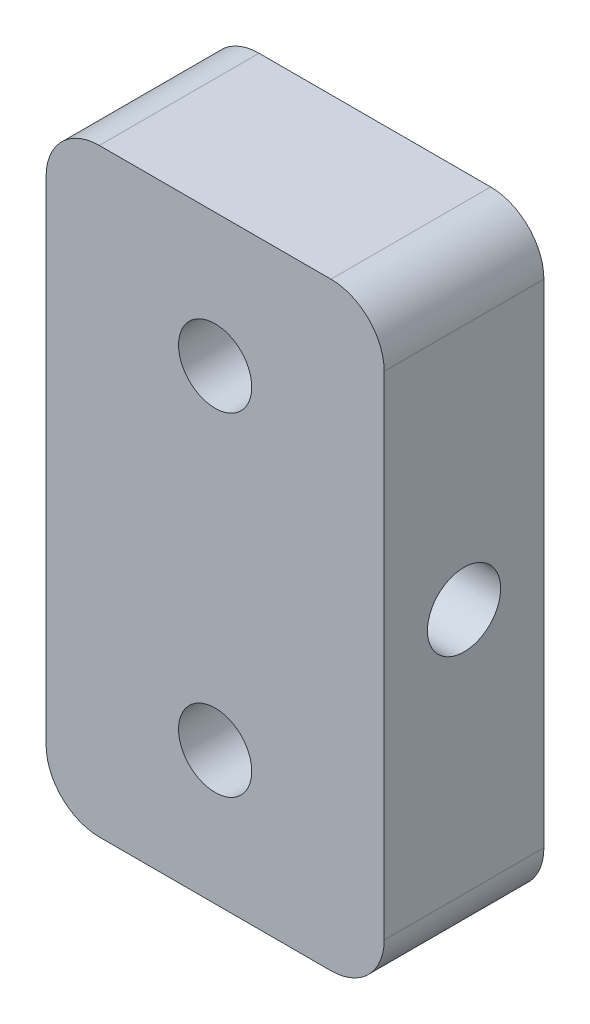
ISO-10303-21;
HEADER;
FILE_DESCRIPTION(('STEP AP214'),'2;1');
FILE_NAME('part.step','',(''),(''),'','','');
FILE_SCHEMA(('AUTOMOTIVE_DESIGN { 1 0 10303 214 1 1 1 1 }'));
ENDSEC;
DATA;
#1=APPLICATION_CONTEXT('core data for automotive mechanical design processes');
#2=APPLICATION_PROTOCOL_DEFINITION('international standard','automotive_design',2000,#1);
#3=PRODUCT_CONTEXT('',#1,'mechanical');
#4=PRODUCT('Part','Part','',(#3));
#5=PRODUCT_RELATED_PRODUCT_CATEGORY('part','',(#4));
#6=PRODUCT_DEFINITION_FORMATION('','',#4);
#7=PRODUCT_DEFINITION_CONTEXT('part definition',#1,'design');
#8=PRODUCT_DEFINITION('design','',#6,#7);
#9=PRODUCT_DEFINITION_SHAPE('','',#8);
#10=(LENGTH_UNIT() NAMED_UNIT(*) SI_UNIT(.MILLI.,.METRE.));
#11=(NAMED_UNIT(*) PLANE_ANGLE_UNIT() SI_UNIT($,.RADIAN.));
#12=(NAMED_UNIT(*) SI_UNIT($,.STERADIAN.) SOLID_ANGLE_UNIT());
#13=UNCERTAINTY_MEASURE_WITH_UNIT(LENGTH_MEASURE(1.E-05),#10,'distance_accuracy_value','');
#14=(GEOMETRIC_REPRESENTATION_CONTEXT(3) GLOBAL_UNCERTAINTY_ASSIGNED_CONTEXT((#13)) GLOBAL_UNIT_ASSIGNED_CONTEXT((#10,
#11,#12)) REPRESENTATION_CONTEXT('',''));
#15=CARTESIAN_POINT('',(0.,0.,0.));
#16=DIRECTION('',(0.,0.,1.));
#17=DIRECTION('',(1.,0.,0.));
#18=AXIS2_PLACEMENT_3D('',#15,#16,#17);
#19=CARTESIAN_POINT('',(-12.7,-22.5,6.));
#20=DIRECTION('',(1.,0.,0.));
#21=DIRECTION('',(0.,0.,-1.));
#22=AXIS2_PLACEMENT_3D('',#19,#20,#21);
#23=PLANE('',#22);
#24=CARTESIAN_POINT('',(-12.7,0.,0.));
#25=DIRECTION('',(-1.,0.,0.));
#26=DIRECTION('',(0.,0.,1.));
#27=AXIS2_PLACEMENT_3D('',#24,#25,#26);
#28=CIRCLE('',#27,2.74999999999999);
#29=CARTESIAN_POINT('',(-12.7,0.,2.74999999999999));
#30=VERTEX_POINT('',#29);
#31=EDGE_CURVE('E186',#30,#30,#28,.T.);
#32=ORIENTED_EDGE('',*,*,#31,.F.);
#33=EDGE_LOOP('',(#32));
#34=FACE_BOUND('',#33,.T.);
#35=DIRECTION('',(0.,-1.,0.));
#36=VECTOR('',#35,1.);
#37=CARTESIAN_POINT('',(-12.7,-22.5,-6.));
#38=LINE('',#37,#36);
#39=CARTESIAN_POINT('',(-12.7,18.5,-6.));
#40=VERTEX_POINT('',#39);
#41=CARTESIAN_POINT('',(-12.7,-18.5,-6.));
#42=VERTEX_POINT('',#41);
#43=EDGE_CURVE('E134',#40,#42,#38,.T.);
#44=ORIENTED_EDGE('',*,*,#43,.T.);
#45=DIRECTION('',(0.,0.,-1.));
#46=VECTOR('',#45,1.);
#47=CARTESIAN_POINT('',(-12.7,-18.5,6.));
#48=LINE('',#47,#46);
#49=CARTESIAN_POINT('',(-12.7,-18.5,6.));
#50=VERTEX_POINT('',#49);
#51=EDGE_CURVE('E112',#42,#50,#48,.F.);
#52=ORIENTED_EDGE('',*,*,#51,.T.);
#53=DIRECTION('',(0.,-1.,0.));
#54=VECTOR('',#53,1.);
#55=CARTESIAN_POINT('',(-12.7,-22.5,6.));
#56=LINE('',#55,#54);
#57=CARTESIAN_POINT('',(-12.7,18.5,6.));
#58=VERTEX_POINT('',#57);
#59=EDGE_CURVE('E144',#58,#50,#56,.T.);
#60=ORIENTED_EDGE('',*,*,#59,.F.);
#61=DIRECTION('',(0.,0.,-1.));
#62=VECTOR('',#61,1.);
#63=CARTESIAN_POINT('',(-12.7,18.5,6.));
#64=LINE('',#63,#62);
#65=EDGE_CURVE('E117',#58,#40,#64,.T.);
#66=ORIENTED_EDGE('',*,*,#65,.T.);
#67=EDGE_LOOP('',(#44,#52,#60,#66));
#68=FACE_BOUND('',#67,.T.);
#69=ADVANCED_FACE('F41',(#34,#68),#23,.F.);
#70=CARTESIAN_POINT('',(12.7,-22.5,6.));
#71=DIRECTION('',(0.,1.,0.));
#72=DIRECTION('',(0.,0.,1.));
#73=AXIS2_PLACEMENT_3D('',#70,#71,#72);
#74=PLANE('',#73);
#75=DIRECTION('',(1.,0.,0.));
#76=VECTOR('',#75,1.);
#77=CARTESIAN_POINT('',(12.7,-22.5,6.));
#78=LINE('',#77,#76);
#79=CARTESIAN_POINT('',(-8.7,-22.5,6.));
#80=VERTEX_POINT('',#79);
#81=CARTESIAN_POINT('',(8.7,-22.5,6.));
#82=VERTEX_POINT('',#81);
#83=EDGE_CURVE('E127',#80,#82,#78,.T.);
#84=ORIENTED_EDGE('',*,*,#83,.F.);
#85=DIRECTION('',(0.,0.,-1.));
#86=VECTOR('',#85,1.);
#87=CARTESIAN_POINT('',(-8.7,-22.5,6.));
#88=LINE('',#87,#86);
#89=CARTESIAN_POINT('',(-8.7,-22.5,-6.));
#90=VERTEX_POINT('',#89);
#91=EDGE_CURVE('E111',#80,#90,#88,.T.);
#92=ORIENTED_EDGE('',*,*,#91,.T.);
#93=DIRECTION('',(1.,0.,0.));
#94=VECTOR('',#93,1.);
#95=CARTESIAN_POINT('',(12.7,-22.5,-6.));
#96=LINE('',#95,#94);
#97=CARTESIAN_POINT('',(8.7,-22.5,-6.));
#98=VERTEX_POINT('',#97);
#99=EDGE_CURVE('E124',#90,#98,#96,.T.);
#100=ORIENTED_EDGE('',*,*,#99,.T.);
#101=DIRECTION('',(0.,0.,-1.));
#102=VECTOR('',#101,1.);
#103=CARTESIAN_POINT('',(8.7,-22.5,6.));
#104=LINE('',#103,#102);
#105=EDGE_CURVE('E129',#98,#82,#104,.F.);
#106=ORIENTED_EDGE('',*,*,#105,.T.);
#107=EDGE_LOOP('',(#84,#92,#100,#106));
#108=FACE_BOUND('',#107,.T.);
#109=ADVANCED_FACE('F123',(#108),#74,.F.);
#110=CARTESIAN_POINT('',(12.7,-22.5,6.));
#111=DIRECTION('',(-1.,0.,0.));
#112=DIRECTION('',(0.,0.,1.));
#113=AXIS2_PLACEMENT_3D('',#110,#111,#112);
#114=PLANE('',#113);
#115=CARTESIAN_POINT('',(12.7,0.,0.));
#116=DIRECTION('',(-1.,0.,0.));
#117=DIRECTION('',(0.,0.,1.));
#118=AXIS2_PLACEMENT_3D('',#115,#116,#117);
#119=CIRCLE('',#118,2.75);
#120=CARTESIAN_POINT('',(12.7,0.,2.75));
#121=VERTEX_POINT('',#120);
#122=EDGE_CURVE('E139',#121,#121,#119,.T.);
#123=ORIENTED_EDGE('',*,*,#122,.T.);
#124=EDGE_LOOP('',(#123));
#125=FACE_BOUND('',#124,.T.);
#126=DIRECTION('',(0.,1.,0.));
#127=VECTOR('',#126,1.);
#128=CARTESIAN_POINT('',(12.7,-22.5,6.));
#129=LINE('',#128,#127);
#130=CARTESIAN_POINT('',(12.7,-18.5,6.));
#131=VERTEX_POINT('',#130);
#132=CARTESIAN_POINT('',(12.7,18.5,6.));
#133=VERTEX_POINT('',#132);
#134=EDGE_CURVE('E170',#131,#133,#129,.T.);
#135=ORIENTED_EDGE('',*,*,#134,.F.);
#136=DIRECTION('',(0.,0.,-1.));
#137=VECTOR('',#136,1.);
#138=CARTESIAN_POINT('',(12.7,-18.5,6.));
#139=LINE('',#138,#137);
#140=CARTESIAN_POINT('',(12.7,-18.5,-6.));
#141=VERTEX_POINT('',#140);
#142=EDGE_CURVE('E163',#131,#141,#139,.T.);
#143=ORIENTED_EDGE('',*,*,#142,.T.);
#144=DIRECTION('',(0.,1.,0.));
#145=VECTOR('',#144,1.);
#146=CARTESIAN_POINT('',(12.7,-22.5,-6.));
#147=LINE('',#146,#145);
#148=CARTESIAN_POINT('',(12.7,18.5,-6.));
#149=VERTEX_POINT('',#148);
#150=EDGE_CURVE('E133',#141,#149,#147,.T.);
#151=ORIENTED_EDGE('',*,*,#150,.T.);
#152=DIRECTION('',(0.,0.,-1.));
#153=VECTOR('',#152,1.);
#154=CARTESIAN_POINT('',(12.7,18.5,6.));
#155=LINE('',#154,#153);
#156=EDGE_CURVE('E161',#149,#133,#155,.F.);
#157=ORIENTED_EDGE('',*,*,#156,.T.);
#158=EDGE_LOOP('',(#135,#143,#151,#157));
#159=FACE_BOUND('',#158,.T.);
#160=ADVANCED_FACE('F168',(#125,#159),#114,.F.);
#161=CARTESIAN_POINT('',(12.7,22.5,6.));
#162=DIRECTION('',(0.,-1.,0.));
#163=DIRECTION('',(0.,0.,-1.));
#164=AXIS2_PLACEMENT_3D('',#161,#162,#163);
#165=PLANE('',#164);
#166=DIRECTION('',(-1.,0.,0.));
#167=VECTOR('',#166,1.);
#168=CARTESIAN_POINT('',(12.7,22.5,6.));
#169=LINE('',#168,#167);
#170=CARTESIAN_POINT('',(8.7,22.5,6.));
#171=VERTEX_POINT('',#170);
#172=CARTESIAN_POINT('',(-8.7,22.5,6.));
#173=VERTEX_POINT('',#172);
#174=EDGE_CURVE('E145',#171,#173,#169,.T.);
#175=ORIENTED_EDGE('',*,*,#174,.F.);
#176=DIRECTION('',(0.,0.,-1.));
#177=VECTOR('',#176,1.);
#178=CARTESIAN_POINT('',(8.7,22.5,6.));
#179=LINE('',#178,#177);
#180=CARTESIAN_POINT('',(8.7,22.5,-6.));
#181=VERTEX_POINT('',#180);
#182=EDGE_CURVE('E11',#171,#181,#179,.T.);
#183=ORIENTED_EDGE('',*,*,#182,.T.);
#184=DIRECTION('',(-1.,0.,0.));
#185=VECTOR('',#184,1.);
#186=CARTESIAN_POINT('',(12.7,22.5,-6.));
#187=LINE('',#186,#185);
#188=CARTESIAN_POINT('',(-8.7,22.5,-6.));
#189=VERTEX_POINT('',#188);
#190=EDGE_CURVE('E137',#181,#189,#187,.T.);
#191=ORIENTED_EDGE('',*,*,#190,.T.);
#192=DIRECTION('',(0.,0.,-1.));
#193=VECTOR('',#192,1.);
#194=CARTESIAN_POINT('',(-8.7,22.5,6.));
#195=LINE('',#194,#193);
#196=EDGE_CURVE('E49',#189,#173,#195,.F.);
#197=ORIENTED_EDGE('',*,*,#196,.T.);
#198=EDGE_LOOP('',(#175,#183,#191,#197));
#199=FACE_BOUND('',#198,.T.);
#200=ADVANCED_FACE('F177',(#199),#165,.F.);
#201=CARTESIAN_POINT('',(0.,0.,6.));
#202=DIRECTION('',(0.,0.,1.));
#203=DIRECTION('',(1.,0.,0.));
#204=AXIS2_PLACEMENT_3D('',#201,#202,#203);
#205=PLANE('',#204);
#206=CARTESIAN_POINT('',(0.,12.5,6.));
#207=DIRECTION('',(0.,0.,-1.));
#208=DIRECTION('',(-1.,0.,0.));
#209=AXIS2_PLACEMENT_3D('',#206,#207,#208);
#210=CIRCLE('',#209,2.75);
#211=CARTESIAN_POINT('',(-2.74999999999999,12.5,6.));
#212=VERTEX_POINT('',#211);
#213=EDGE_CURVE('E195',#212,#212,#210,.T.);
#214=ORIENTED_EDGE('',*,*,#213,.T.);
#215=EDGE_LOOP('',(#214));
#216=FACE_BOUND('',#215,.T.);
#217=CARTESIAN_POINT('',(0.,-12.5,6.));
#218=DIRECTION('',(0.,0.,-1.));
#219=DIRECTION('',(-1.,0.,0.));
#220=AXIS2_PLACEMENT_3D('',#217,#218,#219);
#221=CIRCLE('',#220,2.75);
#222=CARTESIAN_POINT('',(-2.75,-12.5,6.));
#223=VERTEX_POINT('',#222);
#224=EDGE_CURVE('E189',#223,#223,#221,.T.);
#225=ORIENTED_EDGE('',*,*,#224,.T.);
#226=EDGE_LOOP('',(#225));
#227=FACE_BOUND('',#226,.T.);
#228=ORIENTED_EDGE('',*,*,#59,.T.);
#229=CARTESIAN_POINT('',(-8.7,-18.5,6.));
#230=DIRECTION('',(0.,0.,1.));
#231=DIRECTION('',(1.,0.,0.));
#232=AXIS2_PLACEMENT_3D('',#229,#230,#231);
#233=CIRCLE('',#232,4.);
#234=EDGE_CURVE('E159',#50,#80,#233,.T.);
#235=ORIENTED_EDGE('',*,*,#234,.T.);
#236=ORIENTED_EDGE('',*,*,#83,.T.);
#237=CARTESIAN_POINT('',(8.7,-18.5,6.));
#238=DIRECTION('',(0.,0.,1.));
#239=DIRECTION('',(1.,0.,0.));
#240=AXIS2_PLACEMENT_3D('',#237,#238,#239);
#241=CIRCLE('',#240,4.);
#242=EDGE_CURVE('E157',#82,#131,#241,.T.);
#243=ORIENTED_EDGE('',*,*,#242,.T.);
#244=ORIENTED_EDGE('',*,*,#134,.T.);
#245=CARTESIAN_POINT('',(8.7,18.5,6.));
#246=DIRECTION('',(0.,0.,1.));
#247=DIRECTION('',(1.,0.,0.));
#248=AXIS2_PLACEMENT_3D('',#245,#246,#247);
#249=CIRCLE('',#248,4.);
#250=EDGE_CURVE('E62',#133,#171,#249,.T.);
#251=ORIENTED_EDGE('',*,*,#250,.T.);
#252=ORIENTED_EDGE('',*,*,#174,.T.);
#253=CARTESIAN_POINT('',(-8.7,18.5,6.));
#254=DIRECTION('',(0.,0.,1.));
#255=DIRECTION('',(1.,0.,0.));
#256=AXIS2_PLACEMENT_3D('',#253,#254,#255);
#257=CIRCLE('',#256,4.);
#258=EDGE_CURVE('E154',#173,#58,#257,.T.);
#259=ORIENTED_EDGE('',*,*,#258,.T.);
#260=EDGE_LOOP('',(#228,#235,#236,#243,#244,#251,#252,#259));
#261=FACE_BOUND('',#260,.T.);
#262=ADVANCED_FACE('F206',(#216,#227,#261),#205,.T.);
#263=CARTESIAN_POINT('',(0.,0.,-6.));
#264=DIRECTION('',(0.,0.,1.));
#265=DIRECTION('',(1.,0.,0.));
#266=AXIS2_PLACEMENT_3D('',#263,#264,#265);
#267=PLANE('',#266);
#268=CARTESIAN_POINT('',(0.,12.5,-6.));
#269=DIRECTION('',(0.,0.,-1.));
#270=DIRECTION('',(-1.,0.,0.));
#271=AXIS2_PLACEMENT_3D('',#268,#269,#270);
#272=CIRCLE('',#271,2.74999999999999);
#273=CARTESIAN_POINT('',(-2.74999999999998,12.5,-6.));
#274=VERTEX_POINT('',#273);
#275=EDGE_CURVE('E198',#274,#274,#272,.T.);
#276=ORIENTED_EDGE('',*,*,#275,.F.);
#277=EDGE_LOOP('',(#276));
#278=FACE_BOUND('',#277,.T.);
#279=CARTESIAN_POINT('',(0.,-12.5,-6.));
#280=DIRECTION('',(0.,0.,-1.));
#281=DIRECTION('',(-1.,0.,0.));
#282=AXIS2_PLACEMENT_3D('',#279,#280,#281);
#283=CIRCLE('',#282,2.74999999999999);
#284=CARTESIAN_POINT('',(-2.74999999999999,-12.5,-6.));
#285=VERTEX_POINT('',#284);
#286=EDGE_CURVE('E192',#285,#285,#283,.T.);
#287=ORIENTED_EDGE('',*,*,#286,.F.);
#288=EDGE_LOOP('',(#287));
#289=FACE_BOUND('',#288,.T.);
#290=ORIENTED_EDGE('',*,*,#99,.F.);
#291=CARTESIAN_POINT('',(-8.7,-18.5,-6.));
#292=DIRECTION('',(0.,0.,1.));
#293=DIRECTION('',(1.,0.,0.));
#294=AXIS2_PLACEMENT_3D('',#291,#292,#293);
#295=CIRCLE('',#294,4.);
#296=EDGE_CURVE('E107',#90,#42,#295,.F.);
#297=ORIENTED_EDGE('',*,*,#296,.T.);
#298=ORIENTED_EDGE('',*,*,#43,.F.);
#299=CARTESIAN_POINT('',(-8.7,18.5,-6.));
#300=DIRECTION('',(0.,0.,1.));
#301=DIRECTION('',(1.,0.,0.));
#302=AXIS2_PLACEMENT_3D('',#299,#300,#301);
#303=CIRCLE('',#302,4.);
#304=EDGE_CURVE('E128',#40,#189,#303,.F.);
#305=ORIENTED_EDGE('',*,*,#304,.T.);
#306=ORIENTED_EDGE('',*,*,#190,.F.);
#307=CARTESIAN_POINT('',(8.7,18.5,-6.));
#308=DIRECTION('',(0.,0.,1.));
#309=DIRECTION('',(1.,0.,0.));
#310=AXIS2_PLACEMENT_3D('',#307,#308,#309);
#311=CIRCLE('',#310,4.);
#312=EDGE_CURVE('E148',#181,#149,#311,.F.);
#313=ORIENTED_EDGE('',*,*,#312,.T.);
#314=ORIENTED_EDGE('',*,*,#150,.F.);
#315=CARTESIAN_POINT('',(8.7,-18.5,-6.));
#316=DIRECTION('',(0.,0.,1.));
#317=DIRECTION('',(1.,0.,0.));
#318=AXIS2_PLACEMENT_3D('',#315,#316,#317);
#319=CIRCLE('',#318,4.);
#320=EDGE_CURVE('E118',#141,#98,#319,.F.);
#321=ORIENTED_EDGE('',*,*,#320,.T.);
#322=EDGE_LOOP('',(#290,#297,#298,#305,#306,#313,#314,#321));
#323=FACE_BOUND('',#322,.T.);
#324=ADVANCED_FACE('F131',(#278,#289,#323),#267,.F.);
#325=CARTESIAN_POINT('',(-8.7,-18.5,6.));
#326=DIRECTION('',(0.,0.,-1.));
#327=DIRECTION('',(-1.,0.,0.));
#328=AXIS2_PLACEMENT_3D('',#325,#326,#327);
#329=CYLINDRICAL_SURFACE('',#328,4.);
#330=ORIENTED_EDGE('',*,*,#234,.F.);
#331=ORIENTED_EDGE('',*,*,#51,.F.);
#332=ORIENTED_EDGE('',*,*,#296,.F.);
#333=ORIENTED_EDGE('',*,*,#91,.F.);
#334=EDGE_LOOP('',(#330,#331,#332,#333));
#335=FACE_BOUND('',#334,.T.);
#336=ADVANCED_FACE('F110',(#335),#329,.T.);
#337=CARTESIAN_POINT('',(8.7,-18.5,6.));
#338=DIRECTION('',(0.,0.,-1.));
#339=DIRECTION('',(-1.,0.,0.));
#340=AXIS2_PLACEMENT_3D('',#337,#338,#339);
#341=CYLINDRICAL_SURFACE('',#340,4.);
#342=ORIENTED_EDGE('',*,*,#242,.F.);
#343=ORIENTED_EDGE('',*,*,#105,.F.);
#344=ORIENTED_EDGE('',*,*,#320,.F.);
#345=ORIENTED_EDGE('',*,*,#142,.F.);
#346=EDGE_LOOP('',(#342,#343,#344,#345));
#347=FACE_BOUND('',#346,.T.);
#348=ADVANCED_FACE('F237',(#347),#341,.T.);
#349=CARTESIAN_POINT('',(8.7,18.5,6.));
#350=DIRECTION('',(0.,0.,-1.));
#351=DIRECTION('',(-1.,0.,0.));
#352=AXIS2_PLACEMENT_3D('',#349,#350,#351);
#353=CYLINDRICAL_SURFACE('',#352,4.);
#354=ORIENTED_EDGE('',*,*,#250,.F.);
#355=ORIENTED_EDGE('',*,*,#156,.F.);
#356=ORIENTED_EDGE('',*,*,#312,.F.);
#357=ORIENTED_EDGE('',*,*,#182,.F.);
#358=EDGE_LOOP('',(#354,#355,#356,#357));
#359=FACE_BOUND('',#358,.T.);
#360=ADVANCED_FACE('F176',(#359),#353,.T.);
#361=CARTESIAN_POINT('',(-8.7,18.5,6.));
#362=DIRECTION('',(0.,0.,-1.));
#363=DIRECTION('',(-1.,0.,0.));
#364=AXIS2_PLACEMENT_3D('',#361,#362,#363);
#365=CYLINDRICAL_SURFACE('',#364,4.);
#366=ORIENTED_EDGE('',*,*,#258,.F.);
#367=ORIENTED_EDGE('',*,*,#196,.F.);
#368=ORIENTED_EDGE('',*,*,#304,.F.);
#369=ORIENTED_EDGE('',*,*,#65,.F.);
#370=EDGE_LOOP('',(#366,#367,#368,#369));
#371=FACE_BOUND('',#370,.T.);
#372=ADVANCED_FACE('F43',(#371),#365,.T.);
#373=CARTESIAN_POINT('',(-12.7,0.,0.));
#374=DIRECTION('',(-1.,0.,0.));
#375=DIRECTION('',(0.,0.,1.));
#376=AXIS2_PLACEMENT_3D('',#373,#374,#375);
#377=CYLINDRICAL_SURFACE('',#376,2.74999999999999);
#378=ORIENTED_EDGE('',*,*,#122,.F.);
#379=EDGE_LOOP('',(#378));
#380=FACE_BOUND('',#379,.T.);
#381=ORIENTED_EDGE('',*,*,#31,.T.);
#382=EDGE_LOOP('',(#381));
#383=FACE_BOUND('',#382,.T.);
#384=ADVANCED_FACE('F212',(#380,#383),#377,.F.);
#385=CARTESIAN_POINT('',(0.,-12.5,-6.));
#386=DIRECTION('',(0.,0.,-1.));
#387=DIRECTION('',(-1.,0.,0.));
#388=AXIS2_PLACEMENT_3D('',#385,#386,#387);
#389=CYLINDRICAL_SURFACE('',#388,2.74999999999999);
#390=ORIENTED_EDGE('',*,*,#224,.F.);
#391=EDGE_LOOP('',(#390));
#392=FACE_BOUND('',#391,.T.);
#393=ORIENTED_EDGE('',*,*,#286,.T.);
#394=EDGE_LOOP('',(#393));
#395=FACE_BOUND('',#394,.T.);
#396=ADVANCED_FACE('F210',(#392,#395),#389,.F.);
#397=CARTESIAN_POINT('',(0.,12.5,-6.));
#398=DIRECTION('',(0.,0.,-1.));
#399=DIRECTION('',(-1.,0.,0.));
#400=AXIS2_PLACEMENT_3D('',#397,#398,#399);
#401=CYLINDRICAL_SURFACE('',#400,2.74999999999999);
#402=ORIENTED_EDGE('',*,*,#213,.F.);
#403=EDGE_LOOP('',(#402));
#404=FACE_BOUND('',#403,.T.);
#405=ORIENTED_EDGE('',*,*,#275,.T.);
#406=EDGE_LOOP('',(#405));
#407=FACE_BOUND('',#406,.T.);
#408=ADVANCED_FACE('F202',(#404,#407),#401,.F.);
#409=CLOSED_SHELL('',(#69,#109,#160,#200,#262,#324,#336,#348,#360,#372,#384,#396,#408));
#410=MANIFOLD_SOLID_BREP('B2',#409);
#411=ADVANCED_BREP_SHAPE_REPRESENTATION('',(#18,#410),#14);
#412=SHAPE_DEFINITION_REPRESENTATION(#9,#411);
ENDSEC;
END-ISO-10303-21;
